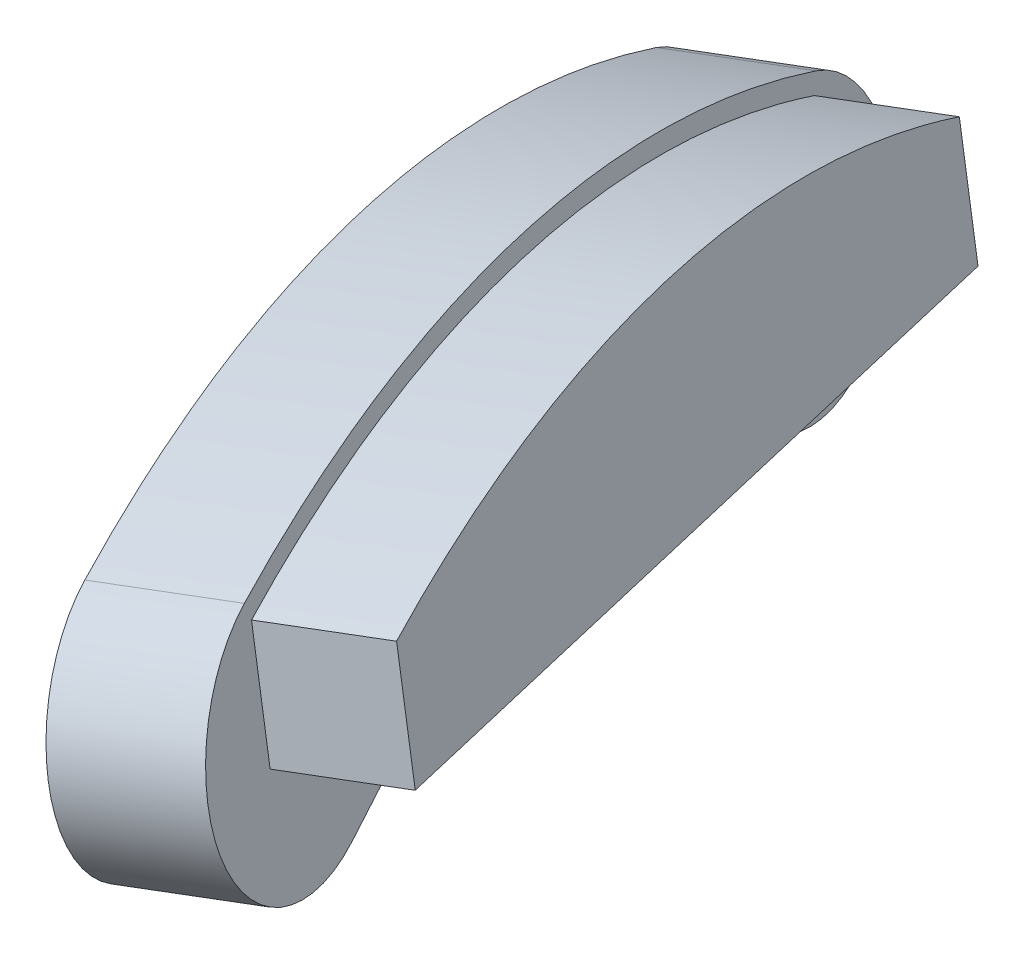
ISO-10303-21;
HEADER;
FILE_DESCRIPTION(('STEP AP214'),'2;1');
FILE_NAME('part.step','',(''),(''),'','','');
FILE_SCHEMA(('AUTOMOTIVE_DESIGN { 1 0 10303 214 1 1 1 1 }'));
ENDSEC;
DATA;
#1=APPLICATION_CONTEXT('core data for automotive mechanical design processes');
#2=APPLICATION_PROTOCOL_DEFINITION('international standard','automotive_design',2000,#1);
#3=PRODUCT_CONTEXT('',#1,'mechanical');
#4=PRODUCT('Part','Part','',(#3));
#5=PRODUCT_RELATED_PRODUCT_CATEGORY('part','',(#4));
#6=PRODUCT_DEFINITION_FORMATION('','',#4);
#7=PRODUCT_DEFINITION_CONTEXT('part definition',#1,'design');
#8=PRODUCT_DEFINITION('design','',#6,#7);
#9=PRODUCT_DEFINITION_SHAPE('','',#8);
#10=(LENGTH_UNIT() NAMED_UNIT(*) SI_UNIT(.MILLI.,.METRE.));
#11=(NAMED_UNIT(*) PLANE_ANGLE_UNIT() SI_UNIT($,.RADIAN.));
#12=(NAMED_UNIT(*) SI_UNIT($,.STERADIAN.) SOLID_ANGLE_UNIT());
#13=UNCERTAINTY_MEASURE_WITH_UNIT(LENGTH_MEASURE(1.E-05),#10,'distance_accuracy_value','');
#14=(GEOMETRIC_REPRESENTATION_CONTEXT(3) GLOBAL_UNCERTAINTY_ASSIGNED_CONTEXT((#13)) GLOBAL_UNIT_ASSIGNED_CONTEXT((#10,
#11,#12)) REPRESENTATION_CONTEXT('',''));
#15=CARTESIAN_POINT('',(0.,0.,0.));
#16=DIRECTION('',(0.,0.,1.));
#17=DIRECTION('',(1.,0.,0.));
#18=AXIS2_PLACEMENT_3D('',#15,#16,#17);
#19=CARTESIAN_POINT('',(-34.2124145152364,34.3238441943944,1.6241322317357));
#20=DIRECTION('',(0.94260125672026,0.173023358316314,-0.285597248422197));
#21=DIRECTION('',(-0.289970666872155,0.,-0.957035533485418));
#22=AXIS2_PLACEMENT_3D('',#19,#20,#21);
#23=PLANE('',#22);
#24=DIRECTION('',(-0.115751796647127,0.971561379342182,0.206567199099177));
#25=VECTOR('',#24,1.);
#26=CARTESIAN_POINT('',(-36.6675739445551,15.2404811857862,-18.0402866317851));
#27=LINE('',#26,#25);
#28=CARTESIAN_POINT('',(-36.8327414692525,16.626812912519,-17.7455336003223));
#29=VERTEX_POINT('',#28);
#30=CARTESIAN_POINT('',(-37.4809821607197,22.067813731426,-16.5887026235505));
#31=VERTEX_POINT('',#30);
#32=EDGE_CURVE('E308',#29,#31,#27,.T.);
#33=ORIENTED_EDGE('',*,*,#32,.F.);
#34=DIRECTION('',(0.277647669354383,0.0690524593628486,0.958198063845895));
#35=VECTOR('',#34,1.);
#36=CARTESIAN_POINT('',(-40.8092338586995,15.6378380013755,-31.4689238139917));
#37=LINE('',#36,#35);
#38=CARTESIAN_POINT('',(-29.3050866455719,18.4989809016055,8.23337806900087));
#39=VERTEX_POINT('',#38);
#40=EDGE_CURVE('E392',#29,#39,#37,.T.);
#41=ORIENTED_EDGE('',*,*,#40,.T.);
#42=DIRECTION('',(0.328557837689843,-0.327906111126755,0.88573547381727));
#43=VECTOR('',#42,1.);
#44=CARTESIAN_POINT('',(-36.339726522997,25.5196668837217,-10.7308022676326));
#45=LINE('',#44,#43);
#46=CARTESIAN_POINT('',(-36.339726522997,25.5196668837217,-10.7308022676326));
#47=VERTEX_POINT('',#46);
#48=EDGE_CURVE('E65',#47,#39,#45,.T.);
#49=ORIENTED_EDGE('',*,*,#48,.F.);
#50=CARTESIAN_POINT('',(-36.0715092286819,21.3403792506206,-12.3775002857392));
#51=DIRECTION('',(0.94260125672026,0.173023358316314,-0.285597248422197));
#52=DIRECTION('',(0.289970666872155,0.,0.957035533485418));
#53=AXIS2_PLACEMENT_3D('',#50,#51,#52);
#54=CIRCLE('',#53,4.49999999999986);
#55=EDGE_CURVE('E60',#31,#47,#54,.T.);
#56=ORIENTED_EDGE('',*,*,#55,.F.);
#57=EDGE_LOOP('',(#33,#41,#49,#56));
#58=FACE_BOUND('',#57,.T.);
#59=ADVANCED_FACE('F41',(#58),#23,.F.);
#60=CARTESIAN_POINT('',(-24.7864019480338,36.0540777775578,-1.23184025248617));
#61=DIRECTION('',(0.94260125672026,0.173023358316314,-0.285597248422197));
#62=DIRECTION('',(-0.289970666872155,0.,-0.957035533485418));
#63=AXIS2_PLACEMENT_3D('',#60,#61,#62);
#64=PLANE('',#63);
#65=DIRECTION('',(0.277647669354383,0.0690524593628486,0.958198063845895));
#66=VECTOR('',#65,1.);
#67=CARTESIAN_POINT('',(-31.3832212914969,17.3680715845389,-34.3248962982136));
#68=LINE('',#67,#66);
#69=CARTESIAN_POINT('',(-31.3832212914969,17.3680715845389,-34.3248962982136));
#70=VERTEX_POINT('',#69);
#71=CARTESIAN_POINT('',(-11.94539889006,22.2023619086702,32.7575461143115));
#72=VERTEX_POINT('',#71);
#73=EDGE_CURVE('E387',#70,#72,#68,.T.);
#74=ORIENTED_EDGE('',*,*,#73,.F.);
#75=DIRECTION('',(0.189928110760556,-0.981264226388443,0.0323702139816128));
#76=VECTOR('',#75,1.);
#77=CARTESIAN_POINT('',(-31.3832212914969,17.3680715845389,-34.3248962982136));
#78=LINE('',#77,#76);
#79=CARTESIAN_POINT('',(-33.2873896626702,27.2059639121698,-34.6494313940721));
#80=VERTEX_POINT('',#79);
#81=EDGE_CURVE('E403',#80,#70,#78,.T.);
#82=ORIENTED_EDGE('',*,*,#81,.F.);
#83=CARTESIAN_POINT('',(-13.8457643593104,32.0206065306355,32.4336591623524));
#84=CARTESIAN_POINT('',(-14.7736887458026,32.8463520893812,29.871346579851));
#85=CARTESIAN_POINT('',(-15.6916899827893,33.5544748128631,27.270525486367));
#86=CARTESIAN_POINT('',(-17.5731702894316,34.7764263042787,21.8010766053963));
#87=CARTESIAN_POINT('',(-18.5259332192669,35.2663303651152,18.9533226664009));
#88=CARTESIAN_POINT('',(-21.3166572222507,36.317934731098,10.3797532539613));
#89=CARTESIAN_POINT('',(-23.0918150194113,36.4674525907677,4.61150479437961));
#90=CARTESIAN_POINT('',(-25.2013000320936,35.9528723968479,-2.66250652309285));
#91=CARTESIAN_POINT('',(-25.6176813863597,35.8146038883443,-4.12052221406061));
#92=CARTESIAN_POINT('',(-26.2338892570691,35.55299697736,-6.31277869793021));
#93=CARTESIAN_POINT('',(-26.4379220986,35.4567095161457,-7.04451401364786));
#94=CARTESIAN_POINT('',(-26.8410199722045,35.2470549295722,-8.5019359783054));
#95=CARTESIAN_POINT('',(-27.040356359266,35.1335819552316,-9.22858234902279));
#96=CARTESIAN_POINT('',(-28.0259641677318,34.5234503975804,-12.8511738681236));
#97=CARTESIAN_POINT('',(-28.7794802047436,33.8984974166754,-15.7167358842615));
#98=CARTESIAN_POINT('',(-30.8914381673948,31.669103173894,-24.0377947241546));
#99=CARTESIAN_POINT('',(-32.1565979940784,29.6976112287452,-29.4077883368383));
#100=CARTESIAN_POINT('',(-33.2873896626702,27.2059639121698,-34.6494313940721));
#101=B_SPLINE_CURVE_WITH_KNOTS('',3,(#83,#84,#85,#86,#87,#88,#89,#90,#91,#92,#93,#94,#95,#96,
#97,#98,#99,#100),.UNSPECIFIED.,.F.,.F.,(4,2,2,2,2,2,2,2,4),(0.00843363175947347,0.125,0.25,0.5,
0.5625,0.59375,0.625,0.75,0.992257633376274),.UNSPECIFIED.);
#102=CARTESIAN_POINT('',(-13.8457643593104,32.0206065306355,32.4336591623524));
#103=VERTEX_POINT('',#102);
#104=EDGE_CURVE('E397',#103,#80,#101,.T.);
#105=ORIENTED_EDGE('',*,*,#104,.F.);
#106=DIRECTION('',(-0.189928110760982,0.981264226388312,-0.0323702139830996));
#107=VECTOR('',#106,1.);
#108=CARTESIAN_POINT('',(-7.57804343520659,-0.361594814738266,33.5018921200051));
#109=LINE('',#108,#107);
#110=EDGE_CURVE('E11',#72,#103,#109,.T.);
#111=ORIENTED_EDGE('',*,*,#110,.F.);
#112=EDGE_LOOP('',(#74,#82,#105,#111));
#113=FACE_BOUND('',#112,.T.);
#114=ADVANCED_FACE('F476',(#113),#64,.T.);
#115=CARTESIAN_POINT('',(-23.271776926513,30.290372947472,35.2896316465743));
#116=CARTESIAN_POINT('',(-24.1997013130052,31.1161185062177,32.7273190640729));
#117=CARTESIAN_POINT('',(-25.1177025499919,31.8242412296996,30.1264979705889));
#118=CARTESIAN_POINT('',(-26.9991828566341,33.0461927211153,24.6570490896182));
#119=CARTESIAN_POINT('',(-27.9519457864695,33.5360967819517,21.8092951506228));
#120=CARTESIAN_POINT('',(-30.7426697894532,34.5877011479346,13.2357257381832));
#121=CARTESIAN_POINT('',(-32.5178275866139,34.7372190076043,7.46747727860148));
#122=CARTESIAN_POINT('',(-34.6273125992962,34.2226388136845,0.193465961129019));
#123=CARTESIAN_POINT('',(-35.0436939535622,34.0843703051808,-1.26454972983874));
#124=CARTESIAN_POINT('',(-35.6599018242716,33.8227633941966,-3.45680621370834));
#125=CARTESIAN_POINT('',(-35.8639346658026,33.7264759329822,-4.18854152942599));
#126=CARTESIAN_POINT('',(-36.2670325394071,33.5168213464088,-5.64596349408353));
#127=CARTESIAN_POINT('',(-36.4663689264686,33.4033483720681,-6.37260986480091));
#128=CARTESIAN_POINT('',(-37.4519767349344,32.7932168144169,-9.99520138390177));
#129=CARTESIAN_POINT('',(-38.2054927719462,32.1682638335119,-12.8607634000397));
#130=CARTESIAN_POINT('',(-40.3174507345974,29.9388695907306,-21.1818222399327));
#131=CARTESIAN_POINT('',(-41.582610561281,27.9673776455817,-26.5518158526164));
#132=CARTESIAN_POINT('',(-42.7134022298728,25.4757303290064,-31.7934589098502));
#133=B_SPLINE_CURVE_WITH_KNOTS('',3,(#115,#116,#117,#118,#119,#120,#121,#122,#123,#124,#125,
#126,#127,#128,#129,#130,#131,#132),.UNSPECIFIED.,.F.,.F.,(4,2,2,2,2,2,2,2,4),
(0.00843363175947347,0.125,0.25,0.5,0.5625,0.59375,0.625,0.75,0.992257633376274),.UNSPECIFIED.);
#134=DIRECTION('',(0.942601256720258,0.173023358316345,-0.285597248422187));
#135=VECTOR('',#134,1.);
#136=SURFACE_OF_LINEAR_EXTRUSION('',#133,#135);
#137=DIRECTION('',(0.942601256720258,0.173023358316345,-0.285597248422187));
#138=VECTOR('',#137,1.);
#139=CARTESIAN_POINT('',(-42.7134022298728,25.4757303290064,-31.7934589098502));
#140=LINE('',#139,#138);
#141=CARTESIAN_POINT('',(-42.7134022298728,25.4757303290064,-31.7934589098502));
#142=VERTEX_POINT('',#141);
#143=EDGE_CURVE('E52',#142,#80,#140,.T.);
#144=ORIENTED_EDGE('',*,*,#143,.F.);
#145=CARTESIAN_POINT('',(-23.2717769265128,30.2903729474721,35.2896316465742));
#146=CARTESIAN_POINT('',(-24.199701313005,31.1161185062178,32.7273190640728));
#147=CARTESIAN_POINT('',(-25.1177025499917,31.8242412296997,30.1264979705888));
#148=CARTESIAN_POINT('',(-26.999182856634,33.0461927211153,24.6570490896181));
#149=CARTESIAN_POINT('',(-27.9519457864693,33.5360967819518,21.8092951506227));
#150=CARTESIAN_POINT('',(-30.7426697894531,34.5877011479346,13.2357257381831));
#151=CARTESIAN_POINT('',(-32.5178275866138,34.7372190076043,7.46747727860146));
#152=CARTESIAN_POINT('',(-34.6273125992962,34.2226388136845,0.193465961129028));
#153=CARTESIAN_POINT('',(-35.0436939535623,34.0843703051808,-1.26454972983872));
#154=CARTESIAN_POINT('',(-35.6599018242717,33.8227633941966,-3.45680621370832));
#155=CARTESIAN_POINT('',(-35.8639346658026,33.7264759329822,-4.18854152942596));
#156=CARTESIAN_POINT('',(-36.2670325394072,33.5168213464088,-5.64596349408349));
#157=CARTESIAN_POINT('',(-36.4663689264687,33.4033483720681,-6.37260986480088));
#158=CARTESIAN_POINT('',(-37.4519767349346,32.7932168144169,-9.99520138390172));
#159=CARTESIAN_POINT('',(-38.2054927719464,32.1682638335119,-12.8607634000396));
#160=CARTESIAN_POINT('',(-40.3174507345978,29.9388695907306,-21.1818222399326));
#161=CARTESIAN_POINT('',(-41.5826105612814,27.9673776455816,-26.5518158526163));
#162=CARTESIAN_POINT('',(-42.7134022298734,25.4757303290063,-31.79345890985));
#163=B_SPLINE_CURVE_WITH_KNOTS('',3,(#145,#146,#147,#148,#149,#150,#151,#152,#153,#154,#155,
#156,#157,#158,#159,#160,#161,#162),.UNSPECIFIED.,.F.,.F.,(4,2,2,2,2,2,2,2,4),
(0.00843363175947347,0.125,0.25,0.5,0.5625,0.59375,0.625,0.75,0.992257633376274),.UNSPECIFIED.);
#164=CARTESIAN_POINT('',(-23.271776926513,30.290372947472,35.2896316465743));
#165=VERTEX_POINT('',#164);
#166=EDGE_CURVE('E177',#165,#142,#163,.T.);
#167=ORIENTED_EDGE('',*,*,#166,.F.);
#168=DIRECTION('',(0.942601256720258,0.173023358316345,-0.285597248422187));
#169=VECTOR('',#168,1.);
#170=CARTESIAN_POINT('',(-23.271776926513,30.290372947472,35.2896316465743));
#171=LINE('',#170,#169);
#172=EDGE_CURVE('E396',#165,#103,#171,.T.);
#173=ORIENTED_EDGE('',*,*,#172,.T.);
#174=ORIENTED_EDGE('',*,*,#104,.T.);
#175=EDGE_LOOP('',(#144,#167,#173,#174));
#176=FACE_BOUND('',#175,.T.);
#177=ADVANCED_FACE('F43',(#176),#136,.F.);
#178=CARTESIAN_POINT('',(-40.8092338586995,15.6378380013755,-31.4689238139917));
#179=DIRECTION('',(0.274645559899148,0.0847551502106111,0.957802892530848));
#180=DIRECTION('',(0.961261695938455,0.,-0.275637355816524));
#181=AXIS2_PLACEMENT_3D('',#178,#179,#180);
#182=PLANE('',#181);
#183=ORIENTED_EDGE('',*,*,#81,.T.);
#184=DIRECTION('',(0.942601256720258,0.173023358316345,-0.285597248422187));
#185=VECTOR('',#184,1.);
#186=CARTESIAN_POINT('',(-40.8092338586995,15.6378380013755,-31.4689238139917));
#187=LINE('',#186,#185);
#188=CARTESIAN_POINT('',(-40.8092338586995,15.6378380013755,-31.4689238139917));
#189=VERTEX_POINT('',#188);
#190=EDGE_CURVE('E419',#189,#70,#187,.T.);
#191=ORIENTED_EDGE('',*,*,#190,.F.);
#192=DIRECTION('',(0.189928110760556,-0.981264226388443,0.0323702139816128));
#193=VECTOR('',#192,1.);
#194=CARTESIAN_POINT('',(-40.8092338586995,15.6378380013755,-31.4689238139917));
#195=LINE('',#194,#193);
#196=EDGE_CURVE('E379',#142,#189,#195,.T.);
#197=ORIENTED_EDGE('',*,*,#196,.F.);
#198=ORIENTED_EDGE('',*,*,#143,.T.);
#199=EDGE_LOOP('',(#183,#191,#197,#198));
#200=FACE_BOUND('',#199,.T.);
#201=ADVANCED_FACE('F474',(#200),#182,.F.);
#202=CARTESIAN_POINT('',(-40.8092338586995,15.6378380013755,-31.4689238139917));
#203=DIRECTION('',(-0.18551183932965,0.982494109566503,-0.0170494027946442));
#204=DIRECTION('',(-0.982636937448411,-0.185538807698033,0.));
#205=AXIS2_PLACEMENT_3D('',#202,#203,#204);
#206=PLANE('',#205);
#207=ORIENTED_EDGE('',*,*,#73,.T.);
#208=DIRECTION('',(0.942601256720258,0.173023358316345,-0.285597248422187));
#209=VECTOR('',#208,1.);
#210=CARTESIAN_POINT('',(-21.3714114572626,20.4721283255067,35.6135185985334));
#211=LINE('',#210,#209);
#212=CARTESIAN_POINT('',(-21.3714114572626,20.4721283255067,35.6135185985334));
#213=VERTEX_POINT('',#212);
#214=EDGE_CURVE('E415',#213,#72,#211,.T.);
#215=ORIENTED_EDGE('',*,*,#214,.F.);
#216=EDGE_CURVE('E386',#39,#213,#37,.T.);
#217=ORIENTED_EDGE('',*,*,#216,.F.);
#218=ORIENTED_EDGE('',*,*,#40,.F.);
#219=EDGE_CURVE('E388',#189,#29,#37,.T.);
#220=ORIENTED_EDGE('',*,*,#219,.F.);
#221=ORIENTED_EDGE('',*,*,#190,.T.);
#222=EDGE_LOOP('',(#207,#215,#217,#218,#220,#221));
#223=FACE_BOUND('',#222,.T.);
#224=ADVANCED_FACE('F455',(#223),#206,.F.);
#225=CARTESIAN_POINT('',(-21.3714114572626,20.4721283255067,35.6135185985334));
#226=DIRECTION('',(-0.274645559898853,-0.0847551502121343,-0.957802892530798));
#227=DIRECTION('',(-0.96126169593853,0.,0.275637355816264));
#228=AXIS2_PLACEMENT_3D('',#225,#226,#227);
#229=PLANE('',#228);
#230=ORIENTED_EDGE('',*,*,#214,.T.);
#231=ORIENTED_EDGE('',*,*,#110,.T.);
#232=ORIENTED_EDGE('',*,*,#172,.F.);
#233=DIRECTION('',(-0.189928110760983,0.981264226388312,-0.0323702139830995));
#234=VECTOR('',#233,1.);
#235=CARTESIAN_POINT('',(-21.3714114572626,20.4721283255067,35.6135185985334));
#236=LINE('',#235,#234);
#237=EDGE_CURVE('E391',#213,#165,#236,.T.);
#238=ORIENTED_EDGE('',*,*,#237,.F.);
#239=EDGE_LOOP('',(#230,#231,#232,#238));
#240=FACE_BOUND('',#239,.T.);
#241=ADVANCED_FACE('F469',(#240),#229,.F.);
#242=CARTESIAN_POINT('',(-22.579475875422,21.3484057293149,32.1572297687716));
#243=DIRECTION('',(0.94260125672026,0.173023358316314,-0.285597248422197));
#244=DIRECTION('',(-0.289970666872155,0.,-0.957035533485418));
#245=AXIS2_PLACEMENT_3D('',#242,#243,#244);
#246=PLANE('',#245);
#247=ORIENTED_EDGE('',*,*,#196,.T.);
#248=ORIENTED_EDGE('',*,*,#219,.T.);
#249=CARTESIAN_POINT('',(-36.6675739445551,15.2404811857862,-18.0402866317851));
#250=VERTEX_POINT('',#249);
#251=EDGE_CURVE('E309',#250,#29,#27,.T.);
#252=ORIENTED_EDGE('',*,*,#251,.F.);
#253=CARTESIAN_POINT('',(-40.11295222287,17.0186543610889,-28.3343367908795));
#254=DIRECTION('',(-0.94260125672026,-0.173023358316314,0.285597248422197));
#255=DIRECTION('',(0.289970666872155,0.,0.957035533485418));
#256=AXIS2_PLACEMENT_3D('',#253,#254,#255);
#257=CIRCLE('',#256,11.);
#258=CARTESIAN_POINT('',(-43.1239995994002,26.8110581134143,-32.3396360865296));
#259=VERTEX_POINT('',#258);
#260=EDGE_CURVE('E302',#259,#250,#257,.T.);
#261=ORIENTED_EDGE('',*,*,#260,.F.);
#262=CARTESIAN_POINT('',(-23.3810876187903,31.7022625082337,35.7842214167536));
#263=CARTESIAN_POINT('',(-24.3750659222919,32.5867884260283,33.0395116635986));
#264=CARTESIAN_POINT('',(-26.3464927509422,34.0938046429676,27.4458989514615));
#265=CARTESIAN_POINT('',(-29.1993743676454,35.5275820802264,18.8987129285159));
#266=CARTESIAN_POINT('',(-31.9186435606594,36.1402362746509,10.295047850982));
#267=CARTESIAN_POINT('',(-34.5102142285401,35.937783236459,1.61902983371458));
#268=CARTESIAN_POINT('',(-36.9820229827456,34.8947772577981,-7.17095133426591));
#269=CARTESIAN_POINT('',(-39.2446702673891,33.0361529336855,-15.7647301958806));
#270=CARTESIAN_POINT('',(-41.3028312619254,30.3964249834072,-24.1568269272819));
#271=CARTESIAN_POINT('',(-42.5443109227349,28.0883753910175,-29.6525618784366));
#272=CARTESIAN_POINT('',(-43.1239995994002,26.8110581134143,-32.3396360865296));
#273=B_SPLINE_CURVE_WITH_KNOTS('',3,(#262,#263,#264,#265,#266,#267,#268,#269,#270,#271,#272),
.UNSPECIFIED.,.F.,.F.,(4,1,1,1,1,1,1,1,4),(0.00843363175947347,0.131411631961573,
0.254389632163673,0.377367632365774,0.500345632567874,0.623323632769974,0.746301632972074,
0.869279633174174,0.992257633376274),.UNSPECIFIED.);
#274=CARTESIAN_POINT('',(-23.3810876187903,31.7022625082337,35.7842214167536));
#275=VERTEX_POINT('',#274);
#276=EDGE_CURVE('E186',#275,#259,#273,.T.);
#277=ORIENTED_EDGE('',*,*,#276,.F.);
#278=CARTESIAN_POINT('',(-22.579475875422,21.3484057293149,32.1572297687716));
#279=DIRECTION('',(-0.94260125672026,-0.173023358316314,0.285597248422197));
#280=DIRECTION('',(-0.289970666872155,0.,-0.957035533485418));
#281=AXIS2_PLACEMENT_3D('',#278,#279,#280);
#282=CIRCLE('',#281,11.);
#283=CARTESIAN_POINT('',(-21.9238336004295,11.1323692928448,28.1319679467333));
#284=VERTEX_POINT('',#283);
#285=EDGE_CURVE('E277',#284,#275,#282,.T.);
#286=ORIENTED_EDGE('',*,*,#285,.F.);
#287=EDGE_CURVE('E315',#39,#284,#45,.T.);
#288=ORIENTED_EDGE('',*,*,#287,.F.);
#289=ORIENTED_EDGE('',*,*,#216,.T.);
#290=ORIENTED_EDGE('',*,*,#237,.T.);
#291=ORIENTED_EDGE('',*,*,#166,.T.);
#292=EDGE_LOOP('',(#247,#248,#252,#261,#277,#286,#288,#289,#290,#291));
#293=FACE_BOUND('',#292,.T.);
#294=ADVANCED_FACE('F238',(#293),#246,.T.);
#295=CARTESIAN_POINT('',(-50.4815660467928,15.1153974196095,-25.1927670582353));
#296=DIRECTION('',(0.94260125672026,0.173023358316314,-0.285597248422197));
#297=DIRECTION('',(-0.289970666872155,0.,-0.957035533485418));
#298=AXIS2_PLACEMENT_3D('',#295,#296,#297);
#299=CYLINDRICAL_SURFACE('',#298,9.50000000000005);
#300=CARTESIAN_POINT('',(-41.0555534795902,16.8456310027726,-28.0487395424573));
#301=DIRECTION('',(-0.94260125672026,-0.173023358316314,0.285597248422197));
#302=DIRECTION('',(0.289970666872155,0.,0.957035533485418));
#303=AXIS2_PLACEMENT_3D('',#300,#301,#302);
#304=CIRCLE('',#303,9.50000000000005);
#305=CARTESIAN_POINT('',(-43.6560034865936,25.30270697069,-31.5078616614278));
#306=VERTEX_POINT('',#305);
#307=CARTESIAN_POINT('',(-38.0799995119546,15.3099359877384,-19.1584234959667));
#308=VERTEX_POINT('',#307);
#309=EDGE_CURVE('E367',#306,#308,#304,.T.);
#310=ORIENTED_EDGE('',*,*,#309,.F.);
#311=DIRECTION('',(0.94260125672026,0.173023358316314,-0.285597248422197));
#312=VECTOR('',#311,1.);
#313=CARTESIAN_POINT('',(-53.0820160537962,23.5724733875268,-28.6518891772058));
#314=LINE('',#313,#312);
#315=CARTESIAN_POINT('',(-53.0820160537962,23.5724733875268,-28.6518891772058));
#316=VERTEX_POINT('',#315);
#317=EDGE_CURVE('E171',#316,#306,#314,.T.);
#318=ORIENTED_EDGE('',*,*,#317,.F.);
#319=CARTESIAN_POINT('',(-50.4815660467928,15.1153974196095,-25.1927670582353));
#320=DIRECTION('',(-0.94260125672026,-0.173023358316314,0.285597248422197));
#321=DIRECTION('',(0.289970666872155,0.,0.957035533485418));
#322=AXIS2_PLACEMENT_3D('',#319,#320,#321);
#323=CIRCLE('',#322,9.50000000000005);
#324=CARTESIAN_POINT('',(-47.5060120791572,13.5797024045753,-16.3024510117447));
#325=VERTEX_POINT('',#324);
#326=EDGE_CURVE('E165',#316,#325,#323,.T.);
#327=ORIENTED_EDGE('',*,*,#326,.T.);
#328=DIRECTION('',(0.94260125672026,0.173023358316314,-0.285597248422197));
#329=VECTOR('',#328,1.);
#330=CARTESIAN_POINT('',(-47.5060120791572,13.5797024045753,-16.3024510117447));
#331=LINE('',#330,#329);
#332=EDGE_CURVE('E169',#325,#308,#331,.T.);
#333=ORIENTED_EDGE('',*,*,#332,.T.);
#334=EDGE_LOOP('',(#310,#318,#327,#333));
#335=FACE_BOUND('',#334,.T.);
#336=ADVANCED_FACE('F168',(#335),#299,.F.);
#337=CARTESIAN_POINT('',(-47.5060120791572,13.5797024045753,-16.3024510117447));
#338=DIRECTION('',(-0.313216207119535,0.161652106845715,-0.935822741735845));
#339=DIRECTION('',(-0.948294898214683,0.,0.317390589053935));
#340=AXIS2_PLACEMENT_3D('',#337,#338,#339);
#341=PLANE('',#340);
#342=DIRECTION('',(-0.115751796647129,0.971561379342184,0.206567199099169));
#343=VECTOR('',#342,1.);
#344=CARTESIAN_POINT('',(-38.0799995119546,15.3099359877384,-19.1584234959667));
#345=LINE('',#344,#343);
#346=CARTESIAN_POINT('',(-38.8934077281193,22.1372685333782,-17.7068394877321));
#347=VERTEX_POINT('',#346);
#348=EDGE_CURVE('E184',#308,#347,#345,.T.);
#349=ORIENTED_EDGE('',*,*,#348,.F.);
#350=ORIENTED_EDGE('',*,*,#332,.F.);
#351=DIRECTION('',(-0.115751796647129,0.971561379342184,0.206567199099169));
#352=VECTOR('',#351,1.);
#353=CARTESIAN_POINT('',(-47.5060120791572,13.5797024045753,-16.3024510117447));
#354=LINE('',#353,#352);
#355=CARTESIAN_POINT('',(-48.3194202953219,20.4070349502151,-14.8508670035101));
#356=VERTEX_POINT('',#355);
#357=EDGE_CURVE('E176',#325,#356,#354,.T.);
#358=ORIENTED_EDGE('',*,*,#357,.T.);
#359=DIRECTION('',(0.94260125672026,0.173023358316314,-0.285597248422197));
#360=VECTOR('',#359,1.);
#361=CARTESIAN_POINT('',(-48.3194202953219,20.4070349502151,-14.8508670035101));
#362=LINE('',#361,#360);
#363=EDGE_CURVE('E187',#356,#347,#362,.T.);
#364=ORIENTED_EDGE('',*,*,#363,.T.);
#365=EDGE_LOOP('',(#349,#350,#358,#364));
#366=FACE_BOUND('',#365,.T.);
#367=ADVANCED_FACE('F180',(#366),#341,.T.);
#368=CARTESIAN_POINT('',(-46.4401230526048,19.4371223091411,-9.23593055309507));
#369=DIRECTION('',(0.94260125672026,0.173023358316314,-0.285597248422197));
#370=DIRECTION('',(-0.289970666872155,0.,-0.957035533485418));
#371=AXIS2_PLACEMENT_3D('',#368,#369,#370);
#372=CYLINDRICAL_SURFACE('',#371,5.9999999999998);
#373=CARTESIAN_POINT('',(-37.0141104854022,21.1673558923043,-12.091903037317));
#374=DIRECTION('',(-0.94260125672026,-0.173023358316314,0.285597248422197));
#375=DIRECTION('',(0.289970666872155,0.,0.957035533485418));
#376=AXIS2_PLACEMENT_3D('',#373,#374,#375);
#377=CIRCLE('',#376,5.9999999999998);
#378=CARTESIAN_POINT('',(-37.3717335444889,26.7397394031058,-9.89630567984158));
#379=VERTEX_POINT('',#378);
#380=EDGE_CURVE('E365',#379,#347,#377,.T.);
#381=ORIENTED_EDGE('',*,*,#380,.T.);
#382=ORIENTED_EDGE('',*,*,#363,.F.);
#383=CARTESIAN_POINT('',(-46.4401230526048,19.4371223091411,-9.23593055309507));
#384=DIRECTION('',(0.94260125672026,0.173023358316314,-0.285597248422197));
#385=DIRECTION('',(0.289970666872155,0.,0.957035533485418));
#386=AXIS2_PLACEMENT_3D('',#383,#384,#385);
#387=CIRCLE('',#386,5.9999999999998);
#388=CARTESIAN_POINT('',(-46.7977461116915,25.0095058199427,-7.04033319561959));
#389=VERTEX_POINT('',#388);
#390=EDGE_CURVE('E192',#356,#389,#387,.T.);
#391=ORIENTED_EDGE('',*,*,#390,.T.);
#392=DIRECTION('',(0.94260125672026,0.173023358316314,-0.285597248422197));
#393=VECTOR('',#392,1.);
#394=CARTESIAN_POINT('',(-46.7977461116915,25.0095058199427,-7.04033319561959));
#395=LINE('',#394,#393);
#396=EDGE_CURVE('E357',#389,#379,#395,.T.);
#397=ORIENTED_EDGE('',*,*,#396,.T.);
#398=EDGE_LOOP('',(#381,#382,#391,#397));
#399=FACE_BOUND('',#398,.T.);
#400=ADVANCED_FACE('F229',(#399),#372,.T.);
#401=CARTESIAN_POINT('',(-46.7977461116915,25.0095058199426,-7.04033319561963));
#402=DIRECTION('',(-0.0596038431811317,0.92873058513364,0.365932892912574));
#403=DIRECTION('',(0.,-0.366584639897102,0.930384706340078));
#404=AXIS2_PLACEMENT_3D('',#401,#402,#403);
#405=PLANE('',#404);
#406=DIRECTION('',(0.328557837689843,-0.327906111126753,0.88573547381727));
#407=VECTOR('',#406,1.);
#408=CARTESIAN_POINT('',(-37.3717335444889,26.7397394031058,-9.8963056798416));
#409=LINE('',#408,#407);
#410=CARTESIAN_POINT('',(-22.9558406219215,12.352441812229,28.9664645345244));
#411=VERTEX_POINT('',#410);
#412=EDGE_CURVE('E373',#379,#411,#409,.T.);
#413=ORIENTED_EDGE('',*,*,#412,.F.);
#414=ORIENTED_EDGE('',*,*,#396,.F.);
#415=DIRECTION('',(0.328557837689843,-0.327906111126753,0.88573547381727));
#416=VECTOR('',#415,1.);
#417=CARTESIAN_POINT('',(-46.7977461116915,25.0095058199426,-7.04033319561963));
#418=LINE('',#417,#416);
#419=CARTESIAN_POINT('',(-32.3818531891241,10.6222082290658,31.8224370187463));
#420=VERTEX_POINT('',#419);
#421=EDGE_CURVE('E196',#389,#420,#418,.T.);
#422=ORIENTED_EDGE('',*,*,#421,.T.);
#423=DIRECTION('',(0.94260125672026,0.173023358316314,-0.285597248422197));
#424=VECTOR('',#423,1.);
#425=CARTESIAN_POINT('',(-32.3818531891241,10.6222082290658,31.8224370187463));
#426=LINE('',#425,#424);
#427=EDGE_CURVE('E353',#420,#411,#426,.T.);
#428=ORIENTED_EDGE('',*,*,#427,.T.);
#429=EDGE_LOOP('',(#413,#414,#422,#428));
#430=FACE_BOUND('',#429,.T.);
#431=ADVANCED_FACE('F225',(#430),#405,.T.);
#432=CARTESIAN_POINT('',(-32.9480896993448,19.4451487878354,35.2987995014158));
#433=DIRECTION('',(0.94260125672026,0.173023358316314,-0.285597248422197));
#434=DIRECTION('',(-0.289970666872155,0.,-0.957035533485418));
#435=AXIS2_PLACEMENT_3D('',#432,#433,#434);
#436=CYLINDRICAL_SURFACE('',#435,9.50000000000002);
#437=CARTESIAN_POINT('',(-23.5220771321422,21.1753823709986,32.4428270171938));
#438=DIRECTION('',(0.94260125672026,0.173023358316314,-0.285597248422197));
#439=DIRECTION('',(-0.289970666872155,0.,-0.957035533485418));
#440=AXIS2_PLACEMENT_3D('',#437,#438,#439);
#441=CIRCLE('',#440,9.50000000000002);
#442=CARTESIAN_POINT('',(-24.2143781832331,30.1173495891557,35.5752288949964));
#443=VERTEX_POINT('',#442);
#444=EDGE_CURVE('E343',#443,#411,#441,.T.);
#445=ORIENTED_EDGE('',*,*,#444,.T.);
#446=ORIENTED_EDGE('',*,*,#427,.F.);
#447=CARTESIAN_POINT('',(-32.9480896993448,19.4451487878354,35.2987995014158));
#448=DIRECTION('',(-0.94260125672026,-0.173023358316314,0.285597248422197));
#449=DIRECTION('',(-0.289970666872155,0.,-0.957035533485418));
#450=AXIS2_PLACEMENT_3D('',#447,#448,#449);
#451=CIRCLE('',#450,9.50000000000002);
#452=CARTESIAN_POINT('',(-33.6403907504357,28.3871160059926,38.4312013792184));
#453=VERTEX_POINT('',#452);
#454=EDGE_CURVE('E201',#420,#453,#451,.T.);
#455=ORIENTED_EDGE('',*,*,#454,.T.);
#456=DIRECTION('',(0.94260125672026,0.173023358316314,-0.285597248422197));
#457=VECTOR('',#456,1.);
#458=CARTESIAN_POINT('',(-33.6403907504357,28.3871160059926,38.4312013792184));
#459=LINE('',#458,#457);
#460=EDGE_CURVE('E346',#453,#443,#459,.T.);
#461=ORIENTED_EDGE('',*,*,#460,.T.);
#462=EDGE_LOOP('',(#445,#446,#455,#461));
#463=FACE_BOUND('',#462,.T.);
#464=ADVANCED_FACE('F221',(#463),#436,.F.);
#465=CARTESIAN_POINT('',(-33.6403907504357,28.3871160059926,38.4312013792184));
#466=CARTESIAN_POINT('',(-34.5683151369279,29.2128615647383,35.868888796717));
#467=CARTESIAN_POINT('',(-35.4863163739146,29.9209842882202,33.268067703233));
#468=CARTESIAN_POINT('',(-37.3677966805569,31.1429357796359,27.7986188222623));
#469=CARTESIAN_POINT('',(-38.3205596103922,31.6328398404723,24.9508648832669));
#470=CARTESIAN_POINT('',(-41.111283613376,32.6844442064552,16.3772954708273));
#471=CARTESIAN_POINT('',(-42.8864414105367,32.8339620661249,10.6090470112456));
#472=CARTESIAN_POINT('',(-44.9959264232191,32.319381872205,3.3350356937732));
#473=CARTESIAN_POINT('',(-45.4123077774852,32.1811133637014,1.87702000280545));
#474=CARTESIAN_POINT('',(-46.0285156481946,31.9195064527171,-0.315236481064145));
#475=CARTESIAN_POINT('',(-46.2325484897255,31.8232189915028,-1.04697179678179));
#476=CARTESIAN_POINT('',(-46.63564636333,31.6135644049293,-2.50439376143932));
#477=CARTESIAN_POINT('',(-46.8349827503916,31.5000914305887,-3.23104013215671));
#478=CARTESIAN_POINT('',(-47.8205905588575,30.8899598729375,-6.85363165125754));
#479=CARTESIAN_POINT('',(-48.5741065958692,30.2650068920324,-9.71919366739543));
#480=CARTESIAN_POINT('',(-50.6860645585206,28.0356126492511,-18.0402525072885));
#481=CARTESIAN_POINT('',(-51.9512243852043,26.0641207041022,-23.4102461199721));
#482=CARTESIAN_POINT('',(-53.0820160537962,23.5724733875268,-28.6518891772058));
#483=B_SPLINE_CURVE_WITH_KNOTS('',3,(#465,#466,#467,#468,#469,#470,#471,#472,#473,#474,#475,
#476,#477,#478,#479,#480,#481,#482),.UNSPECIFIED.,.F.,.F.,(4,2,2,2,2,2,2,2,4),
(0.00843363175947347,0.125,0.25,0.5,0.5625,0.59375,0.625,0.75,0.992257633376274),.UNSPECIFIED.);
#484=DIRECTION('',(0.94260125672026,0.173023358316314,-0.285597248422197));
#485=VECTOR('',#484,1.);
#486=SURFACE_OF_LINEAR_EXTRUSION('',#483,#485);
#487=CARTESIAN_POINT('',(-24.2143781832331,30.1173495891557,35.5752288949964));
#488=CARTESIAN_POINT('',(-25.1423025697253,30.9430951479015,33.012916312495));
#489=CARTESIAN_POINT('',(-26.060303806712,31.6512178713834,30.412095219011));
#490=CARTESIAN_POINT('',(-27.9417841133543,32.873169362799,24.9426463380403));
#491=CARTESIAN_POINT('',(-28.8945470431896,33.3630734236355,22.0948923990449));
#492=CARTESIAN_POINT('',(-31.6852710461734,34.4146777896183,13.5213229866053));
#493=CARTESIAN_POINT('',(-33.4604288433341,34.564195649288,7.75307452702366));
#494=CARTESIAN_POINT('',(-35.5699138560165,34.0496154553682,0.479063209551226));
#495=CARTESIAN_POINT('',(-35.9862952102825,33.9113469468645,-0.978952481416523));
#496=CARTESIAN_POINT('',(-36.602503080992,33.6497400358803,-3.17120896528612));
#497=CARTESIAN_POINT('',(-36.8065359225229,33.5534525746659,-3.90294428100376));
#498=CARTESIAN_POINT('',(-37.2096337961274,33.3437979880925,-5.3603662456613));
#499=CARTESIAN_POINT('',(-37.408970183189,33.2303250137518,-6.08701261637868));
#500=CARTESIAN_POINT('',(-38.3945779916548,32.6201934561006,-9.70960413547952));
#501=CARTESIAN_POINT('',(-39.1480940286666,31.9952404751956,-12.5751661516174));
#502=CARTESIAN_POINT('',(-41.260051991318,29.7658462324142,-20.8962249915104));
#503=CARTESIAN_POINT('',(-42.5252118180017,27.7943542872653,-26.2662186041941));
#504=CARTESIAN_POINT('',(-43.6560034865936,25.30270697069,-31.5078616614278));
#505=B_SPLINE_CURVE_WITH_KNOTS('',3,(#487,#488,#489,#490,#491,#492,#493,#494,#495,#496,#497,
#498,#499,#500,#501,#502,#503,#504),.UNSPECIFIED.,.F.,.F.,(4,2,2,2,2,2,2,2,4),
(0.00843363175947347,0.125,0.25,0.5,0.5625,0.59375,0.625,0.75,0.992257633376274),.UNSPECIFIED.);
#506=EDGE_CURVE('E372',#443,#306,#505,.T.);
#507=ORIENTED_EDGE('',*,*,#506,.F.);
#508=ORIENTED_EDGE('',*,*,#460,.F.);
#509=EDGE_CURVE('E205',#453,#316,#483,.T.);
#510=ORIENTED_EDGE('',*,*,#509,.T.);
#511=ORIENTED_EDGE('',*,*,#317,.T.);
#512=EDGE_LOOP('',(#507,#508,#510,#511));
#513=FACE_BOUND('',#512,.T.);
#514=ADVANCED_FACE('F218',(#513),#486,.T.);
#515=CARTESIAN_POINT('',(-44.8588677335171,33.8944341382347,4.74160570790658));
#516=DIRECTION('',(0.94260125672026,0.173023358316322,-0.285597248422195));
#517=DIRECTION('',(-0.289970666872152,0.,-0.957035533485418));
#518=AXIS2_PLACEMENT_3D('',#515,#516,#517);
#519=PLANE('',#518);
#520=CARTESIAN_POINT('',(-33.7497014427132,29.7990055667543,38.9257911493977));
#521=CARTESIAN_POINT('',(-34.7436797462148,30.6835314845489,36.1810813962428));
#522=CARTESIAN_POINT('',(-36.715106574865,32.1905477014881,30.5874686841056));
#523=CARTESIAN_POINT('',(-39.5679881915683,33.624325138747,22.0402826611601));
#524=CARTESIAN_POINT('',(-42.2872573845823,34.2369793331714,13.4366175836262));
#525=CARTESIAN_POINT('',(-44.878828052463,34.0345262949795,4.76059956635875));
#526=CARTESIAN_POINT('',(-47.3506368066685,32.9915203163186,-4.02938160162174));
#527=CARTESIAN_POINT('',(-49.613284091312,31.1328959922061,-12.6231604632364));
#528=CARTESIAN_POINT('',(-51.6714450858483,28.4931680419277,-21.0152571946377));
#529=CARTESIAN_POINT('',(-52.9129247466577,26.1851184495381,-26.5109921457924));
#530=CARTESIAN_POINT('',(-53.4926134233231,24.9078011719348,-29.1980663538854));
#531=B_SPLINE_CURVE_WITH_KNOTS('',3,(#520,#521,#522,#523,#524,#525,#526,#527,#528,#529,#530),
.UNSPECIFIED.,.F.,.F.,(4,1,1,1,1,1,1,1,4),(0.00843363175947347,0.131411631961573,
0.254389632163673,0.377367632365774,0.500345632567874,0.623323632769974,0.746301632972074,
0.869279633174174,0.992257633376274),.UNSPECIFIED.);
#532=CARTESIAN_POINT('',(-33.7497014427132,29.7990055667543,38.9257911493977));
#533=VERTEX_POINT('',#532);
#534=CARTESIAN_POINT('',(-53.4926134233231,24.9078011719348,-29.1980663538854));
#535=VERTEX_POINT('',#534);
#536=EDGE_CURVE('E269',#533,#535,#531,.T.);
#537=ORIENTED_EDGE('',*,*,#536,.T.);
#538=CARTESIAN_POINT('',(-50.4815660467928,15.1153974196095,-25.1927670582353));
#539=DIRECTION('',(-0.94260125672026,-0.173023358316314,0.285597248422197));
#540=DIRECTION('',(0.289970666872155,0.,0.957035533485418));
#541=AXIS2_PLACEMENT_3D('',#538,#539,#540);
#542=CIRCLE('',#541,11.);
#543=CARTESIAN_POINT('',(-47.036187768478,13.3372242443067,-14.898716899141));
#544=VERTEX_POINT('',#543);
#545=EDGE_CURVE('E276',#535,#544,#542,.T.);
#546=ORIENTED_EDGE('',*,*,#545,.T.);
#547=DIRECTION('',(-0.115751796647127,0.971561379342182,0.206567199099177));
#548=VECTOR('',#547,1.);
#549=CARTESIAN_POINT('',(-47.036187768478,13.3372242443067,-14.898716899141));
#550=LINE('',#549,#548);
#551=CARTESIAN_POINT('',(-47.8495959846426,20.1645567899465,-13.4471328909063));
#552=VERTEX_POINT('',#551);
#553=EDGE_CURVE('E284',#544,#552,#550,.T.);
#554=ORIENTED_EDGE('',*,*,#553,.T.);
#555=CARTESIAN_POINT('',(-46.4401230526048,19.4371223091411,-9.23593055309507));
#556=DIRECTION('',(0.94260125672026,0.173023358316314,-0.285597248422197));
#557=DIRECTION('',(0.289970666872155,0.,0.957035533485418));
#558=AXIS2_PLACEMENT_3D('',#555,#556,#557);
#559=CIRCLE('',#558,4.49999999999986);
#560=CARTESIAN_POINT('',(-46.7083403469198,23.6164099422423,-7.58923253498848));
#561=VERTEX_POINT('',#560);
#562=EDGE_CURVE('E287',#552,#561,#559,.T.);
#563=ORIENTED_EDGE('',*,*,#562,.T.);
#564=DIRECTION('',(0.328557837689843,-0.327906111126755,0.88573547381727));
#565=VECTOR('',#564,1.);
#566=CARTESIAN_POINT('',(-46.7083403469198,23.6164099422423,-7.58923253498848));
#567=LINE('',#566,#565);
#568=CARTESIAN_POINT('',(-32.2924474243524,9.22911235136535,31.2735376793775));
#569=VERTEX_POINT('',#568);
#570=EDGE_CURVE('E290',#561,#569,#567,.T.);
#571=ORIENTED_EDGE('',*,*,#570,.T.);
#572=CARTESIAN_POINT('',(-32.9480896993448,19.4451487878354,35.2987995014158));
#573=DIRECTION('',(-0.94260125672026,-0.173023358316314,0.285597248422197));
#574=DIRECTION('',(-0.289970666872155,0.,-0.957035533485418));
#575=AXIS2_PLACEMENT_3D('',#572,#573,#574);
#576=CIRCLE('',#575,11.);
#577=EDGE_CURVE('E293',#569,#533,#576,.T.);
#578=ORIENTED_EDGE('',*,*,#577,.T.);
#579=EDGE_LOOP('',(#537,#546,#554,#563,#571,#578));
#580=FACE_BOUND('',#579,.T.);
#581=ORIENTED_EDGE('',*,*,#326,.F.);
#582=ORIENTED_EDGE('',*,*,#509,.F.);
#583=ORIENTED_EDGE('',*,*,#454,.F.);
#584=ORIENTED_EDGE('',*,*,#421,.F.);
#585=ORIENTED_EDGE('',*,*,#390,.F.);
#586=ORIENTED_EDGE('',*,*,#357,.F.);
#587=EDGE_LOOP('',(#581,#582,#583,#584,#585,#586));
#588=FACE_BOUND('',#587,.T.);
#589=ADVANCED_FACE('F190',(#580,#588),#519,.F.);
#590=DIRECTION('',(0.94260125672026,0.173023358316314,-0.285597248422197));
#591=VECTOR('',#590,1.);
#592=SURFACE_OF_LINEAR_EXTRUSION('',#531,#591);
#593=ORIENTED_EDGE('',*,*,#276,.T.);
#594=DIRECTION('',(0.94260125672026,0.173023358316314,-0.285597248422197));
#595=VECTOR('',#594,1.);
#596=CARTESIAN_POINT('',(-53.4926134233231,24.9078011719348,-29.1980663538854));
#597=LINE('',#596,#595);
#598=EDGE_CURVE('E339',#535,#259,#597,.T.);
#599=ORIENTED_EDGE('',*,*,#598,.F.);
#600=ORIENTED_EDGE('',*,*,#536,.F.);
#601=DIRECTION('',(0.94260125672026,0.173023358316314,-0.285597248422197));
#602=VECTOR('',#601,1.);
#603=CARTESIAN_POINT('',(-33.7497014427132,29.7990055667543,38.9257911493977));
#604=LINE('',#603,#602);
#605=EDGE_CURVE('E296',#533,#275,#604,.T.);
#606=ORIENTED_EDGE('',*,*,#605,.T.);
#607=EDGE_LOOP('',(#593,#599,#600,#606));
#608=FACE_BOUND('',#607,.T.);
#609=ADVANCED_FACE('F241',(#608),#592,.F.);
#610=CARTESIAN_POINT('',(-50.4815660467928,15.1153974196095,-25.1927670582353));
#611=DIRECTION('',(0.94260125672026,0.173023358316314,-0.285597248422197));
#612=DIRECTION('',(-0.289970666872155,0.,-0.957035533485418));
#613=AXIS2_PLACEMENT_3D('',#610,#611,#612);
#614=CYLINDRICAL_SURFACE('',#613,11.);
#615=ORIENTED_EDGE('',*,*,#260,.T.);
#616=DIRECTION('',(0.94260125672026,0.173023358316314,-0.285597248422197));
#617=VECTOR('',#616,1.);
#618=CARTESIAN_POINT('',(-47.036187768478,13.3372242443067,-14.898716899141));
#619=LINE('',#618,#617);
#620=EDGE_CURVE('E335',#544,#250,#619,.T.);
#621=ORIENTED_EDGE('',*,*,#620,.F.);
#622=ORIENTED_EDGE('',*,*,#545,.F.);
#623=ORIENTED_EDGE('',*,*,#598,.T.);
#624=EDGE_LOOP('',(#615,#621,#622,#623));
#625=FACE_BOUND('',#624,.T.);
#626=ADVANCED_FACE('F259',(#625),#614,.T.);
#627=CARTESIAN_POINT('',(-47.036187768478,13.3372242443067,-14.898716899141));
#628=DIRECTION('',(-0.313216207119536,0.161652106845723,-0.935822741735843));
#629=DIRECTION('',(-0.948294898214683,0.,0.317390589053937));
#630=AXIS2_PLACEMENT_3D('',#627,#628,#629);
#631=PLANE('',#630);
#632=ORIENTED_EDGE('',*,*,#251,.T.);
#633=ORIENTED_EDGE('',*,*,#32,.T.);
#634=DIRECTION('',(0.94260125672026,0.173023358316314,-0.285597248422197));
#635=VECTOR('',#634,1.);
#636=CARTESIAN_POINT('',(-47.8495959846426,20.1645567899465,-13.4471328909063));
#637=LINE('',#636,#635);
#638=EDGE_CURVE('E331',#552,#31,#637,.T.);
#639=ORIENTED_EDGE('',*,*,#638,.F.);
#640=ORIENTED_EDGE('',*,*,#553,.F.);
#641=ORIENTED_EDGE('',*,*,#620,.T.);
#642=EDGE_LOOP('',(#632,#633,#639,#640,#641));
#643=FACE_BOUND('',#642,.T.);
#644=ADVANCED_FACE('F255',(#643),#631,.F.);
#645=CARTESIAN_POINT('',(-46.4401230526048,19.4371223091411,-9.23593055309507));
#646=DIRECTION('',(0.94260125672026,0.173023358316314,-0.285597248422197));
#647=DIRECTION('',(-0.289970666872155,0.,-0.957035533485418));
#648=AXIS2_PLACEMENT_3D('',#645,#646,#647);
#649=CYLINDRICAL_SURFACE('',#648,4.49999999999986);
#650=ORIENTED_EDGE('',*,*,#55,.T.);
#651=DIRECTION('',(0.94260125672026,0.173023358316314,-0.285597248422197));
#652=VECTOR('',#651,1.);
#653=CARTESIAN_POINT('',(-46.7083403469198,23.6164099422423,-7.58923253498848));
#654=LINE('',#653,#652);
#655=EDGE_CURVE('E327',#561,#47,#654,.T.);
#656=ORIENTED_EDGE('',*,*,#655,.F.);
#657=ORIENTED_EDGE('',*,*,#562,.F.);
#658=ORIENTED_EDGE('',*,*,#638,.T.);
#659=EDGE_LOOP('',(#650,#656,#657,#658));
#660=FACE_BOUND('',#659,.T.);
#661=ADVANCED_FACE('F251',(#660),#649,.F.);
#662=CARTESIAN_POINT('',(-46.7083403469198,23.6164099422423,-7.58923253498848));
#663=DIRECTION('',(-0.0596038431811309,0.928730585133639,0.365932892912576));
#664=DIRECTION('',(0.,-0.366584639897104,0.930384706340077));
#665=AXIS2_PLACEMENT_3D('',#662,#663,#664);
#666=PLANE('',#665);
#667=ORIENTED_EDGE('',*,*,#48,.T.);
#668=ORIENTED_EDGE('',*,*,#287,.T.);
#669=DIRECTION('',(0.94260125672026,0.173023358316314,-0.285597248422197));
#670=VECTOR('',#669,1.);
#671=CARTESIAN_POINT('',(-32.2924474243524,9.22911235136535,31.2735376793775));
#672=LINE('',#671,#670);
#673=EDGE_CURVE('E323',#569,#284,#672,.T.);
#674=ORIENTED_EDGE('',*,*,#673,.F.);
#675=ORIENTED_EDGE('',*,*,#570,.F.);
#676=ORIENTED_EDGE('',*,*,#655,.T.);
#677=EDGE_LOOP('',(#667,#668,#674,#675,#676));
#678=FACE_BOUND('',#677,.T.);
#679=ADVANCED_FACE('F247',(#678),#666,.F.);
#680=CARTESIAN_POINT('',(-32.9480896993448,19.4451487878354,35.2987995014158));
#681=DIRECTION('',(0.94260125672026,0.173023358316314,-0.285597248422197));
#682=DIRECTION('',(-0.289970666872155,0.,-0.957035533485418));
#683=AXIS2_PLACEMENT_3D('',#680,#681,#682);
#684=CYLINDRICAL_SURFACE('',#683,11.);
#685=ORIENTED_EDGE('',*,*,#285,.T.);
#686=ORIENTED_EDGE('',*,*,#605,.F.);
#687=ORIENTED_EDGE('',*,*,#577,.F.);
#688=ORIENTED_EDGE('',*,*,#673,.T.);
#689=EDGE_LOOP('',(#685,#686,#687,#688));
#690=FACE_BOUND('',#689,.T.);
#691=ADVANCED_FACE('F243',(#690),#684,.T.);
#692=CARTESIAN_POINT('',(-23.5220771321422,21.1753823709986,32.4428270171938));
#693=DIRECTION('',(0.94260125672026,0.173023358316314,-0.285597248422197));
#694=DIRECTION('',(-0.289970666872155,0.,-0.957035533485418));
#695=AXIS2_PLACEMENT_3D('',#692,#693,#694);
#696=PLANE('',#695);
#697=ORIENTED_EDGE('',*,*,#444,.F.);
#698=ORIENTED_EDGE('',*,*,#506,.T.);
#699=ORIENTED_EDGE('',*,*,#309,.T.);
#700=ORIENTED_EDGE('',*,*,#348,.T.);
#701=ORIENTED_EDGE('',*,*,#380,.F.);
#702=ORIENTED_EDGE('',*,*,#412,.T.);
#703=EDGE_LOOP('',(#697,#698,#699,#700,#701,#702));
#704=FACE_BOUND('',#703,.T.);
#705=ADVANCED_FACE('F246',(#704),#696,.F.);
#706=CLOSED_SHELL('',(#59,#114,#177,#201,#224,#241,#294,#336,#367,#400,#431,#464,#514,#589,#609,
#626,#644,#661,#679,#691,#705));
#707=MANIFOLD_SOLID_BREP('B2',#706);
#708=ADVANCED_BREP_SHAPE_REPRESENTATION('',(#18,#707),#14);
#709=SHAPE_DEFINITION_REPRESENTATION(#9,#708);
ENDSEC;
END-ISO-10303-21;
